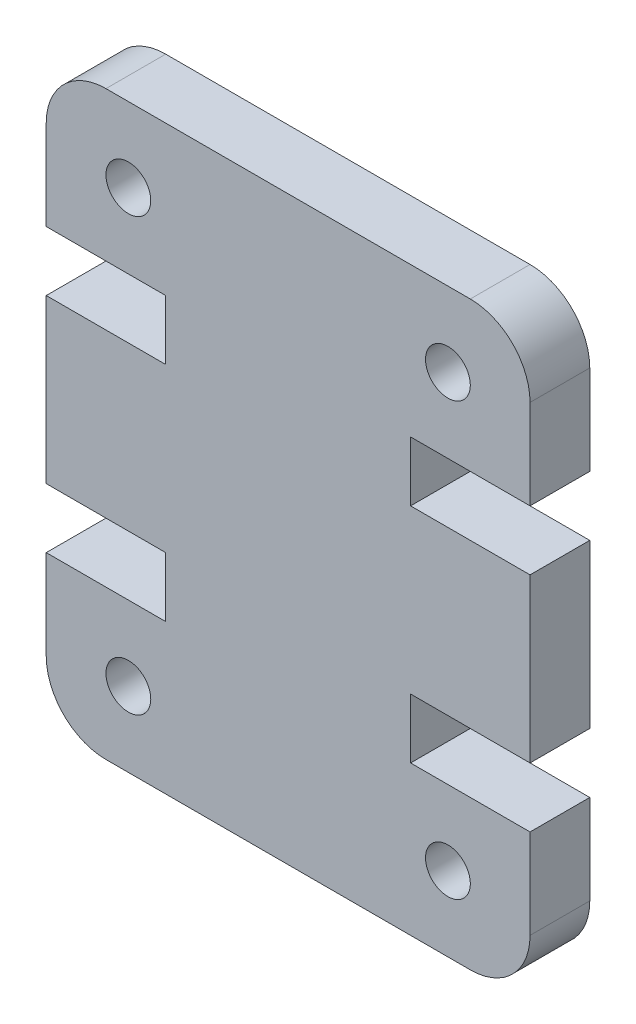
ISO-10303-21;
HEADER;
FILE_DESCRIPTION(('STEP AP214'),'2;1');
FILE_NAME('part.step','',(''),(''),'','','');
FILE_SCHEMA(('AUTOMOTIVE_DESIGN { 1 0 10303 214 1 1 1 1 }'));
ENDSEC;
DATA;
#1=APPLICATION_CONTEXT('core data for automotive mechanical design processes');
#2=APPLICATION_PROTOCOL_DEFINITION('international standard','automotive_design',2000,#1);
#3=PRODUCT_CONTEXT('',#1,'mechanical');
#4=PRODUCT('Part','Part','',(#3));
#5=PRODUCT_RELATED_PRODUCT_CATEGORY('part','',(#4));
#6=PRODUCT_DEFINITION_FORMATION('','',#4);
#7=PRODUCT_DEFINITION_CONTEXT('part definition',#1,'design');
#8=PRODUCT_DEFINITION('design','',#6,#7);
#9=PRODUCT_DEFINITION_SHAPE('','',#8);
#10=(LENGTH_UNIT() NAMED_UNIT(*) SI_UNIT(.MILLI.,.METRE.));
#11=(NAMED_UNIT(*) PLANE_ANGLE_UNIT() SI_UNIT($,.RADIAN.));
#12=(NAMED_UNIT(*) SI_UNIT($,.STERADIAN.) SOLID_ANGLE_UNIT());
#13=UNCERTAINTY_MEASURE_WITH_UNIT(LENGTH_MEASURE(1.E-05),#10,'distance_accuracy_value','');
#14=(GEOMETRIC_REPRESENTATION_CONTEXT(3) GLOBAL_UNCERTAINTY_ASSIGNED_CONTEXT((#13)) GLOBAL_UNIT_ASSIGNED_CONTEXT((#10,
#11,#12)) REPRESENTATION_CONTEXT('',''));
#15=CARTESIAN_POINT('',(0.,0.,0.));
#16=DIRECTION('',(0.,0.,1.));
#17=DIRECTION('',(1.,0.,0.));
#18=AXIS2_PLACEMENT_3D('',#15,#16,#17);
#19=CARTESIAN_POINT('',(14.1999999999999,2.00000000000013,2.));
#20=DIRECTION('',(0.,0.,-1.));
#21=DIRECTION('',(-1.,0.,0.));
#22=AXIS2_PLACEMENT_3D('',#19,#20,#21);
#23=PLANE('',#22);
#24=CARTESIAN_POINT('',(2.75000000000449,16.9549999999999,2.));
#25=DIRECTION('',(0.,0.,1.));
#26=DIRECTION('',(-1.,0.,0.));
#27=AXIS2_PLACEMENT_3D('',#24,#25,#26);
#28=CIRCLE('',#27,0.75);
#29=CARTESIAN_POINT('',(2.00000000000449,16.9549999999999,2.));
#30=VERTEX_POINT('',#29);
#31=EDGE_CURVE('E448',#30,#30,#28,.T.);
#32=ORIENTED_EDGE('',*,*,#31,.F.);
#33=EDGE_LOOP('',(#32));
#34=FACE_BOUND('',#33,.T.);
#35=CARTESIAN_POINT('',(13.4499999999955,2.50000000000005,2.));
#36=DIRECTION('',(0.,0.,1.));
#37=DIRECTION('',(-1.,0.,0.));
#38=AXIS2_PLACEMENT_3D('',#35,#36,#37);
#39=CIRCLE('',#38,0.750000000000006);
#40=CARTESIAN_POINT('',(12.6999999999955,2.50000000000005,2.));
#41=VERTEX_POINT('',#40);
#42=EDGE_CURVE('E230',#41,#41,#39,.T.);
#43=ORIENTED_EDGE('',*,*,#42,.F.);
#44=EDGE_LOOP('',(#43));
#45=FACE_BOUND('',#44,.T.);
#46=CARTESIAN_POINT('',(14.1999999999999,2.00000000000013,2.));
#47=DIRECTION('',(0.,0.,1.));
#48=DIRECTION('',(-1.,0.,0.));
#49=AXIS2_PLACEMENT_3D('',#46,#47,#48);
#50=CIRCLE('',#49,2.00000000000013);
#51=CARTESIAN_POINT('',(14.1999999999999,0.,2.));
#52=VERTEX_POINT('',#51);
#53=CARTESIAN_POINT('',(16.2,2.00000000000013,2.));
#54=VERTEX_POINT('',#53);
#55=EDGE_CURVE('E273',#52,#54,#50,.T.);
#56=ORIENTED_EDGE('',*,*,#55,.T.);
#57=DIRECTION('',(0.,1.,0.));
#58=VECTOR('',#57,1.);
#59=CARTESIAN_POINT('',(16.2,5.00000000000021,2.));
#60=LINE('',#59,#58);
#61=CARTESIAN_POINT('',(16.2,5.00000000000021,2.));
#62=VERTEX_POINT('',#61);
#63=EDGE_CURVE('E141',#54,#62,#60,.T.);
#64=ORIENTED_EDGE('',*,*,#63,.T.);
#65=DIRECTION('',(-1.,0.,0.));
#66=VECTOR('',#65,1.);
#67=CARTESIAN_POINT('',(12.1999999999997,5.00000000000021,2.));
#68=LINE('',#67,#66);
#69=CARTESIAN_POINT('',(12.1999999999997,5.00000000000021,2.));
#70=VERTEX_POINT('',#69);
#71=EDGE_CURVE('E336',#62,#70,#68,.T.);
#72=ORIENTED_EDGE('',*,*,#71,.T.);
#73=DIRECTION('',(0.,1.,0.));
#74=VECTOR('',#73,1.);
#75=CARTESIAN_POINT('',(12.1999999999997,7.00000000000034,2.));
#76=LINE('',#75,#74);
#77=CARTESIAN_POINT('',(12.1999999999997,7.00000000000034,2.));
#78=VERTEX_POINT('',#77);
#79=EDGE_CURVE('E355',#70,#78,#76,.T.);
#80=ORIENTED_EDGE('',*,*,#79,.T.);
#81=DIRECTION('',(1.,0.,0.));
#82=VECTOR('',#81,1.);
#83=CARTESIAN_POINT('',(16.2,7.00000000000034,2.));
#84=LINE('',#83,#82);
#85=CARTESIAN_POINT('',(16.2,7.00000000000034,2.));
#86=VERTEX_POINT('',#85);
#87=EDGE_CURVE('E352',#78,#86,#84,.T.);
#88=ORIENTED_EDGE('',*,*,#87,.T.);
#89=DIRECTION('',(0.,1.,0.));
#90=VECTOR('',#89,1.);
#91=CARTESIAN_POINT('',(16.2,7.00000000000034,2.));
#92=LINE('',#91,#90);
#93=CARTESIAN_POINT('',(16.2,12.4549999999997,2.));
#94=VERTEX_POINT('',#93);
#95=EDGE_CURVE('E354',#86,#94,#92,.T.);
#96=ORIENTED_EDGE('',*,*,#95,.T.);
#97=DIRECTION('',(-1.,0.,0.));
#98=VECTOR('',#97,1.);
#99=CARTESIAN_POINT('',(16.2,12.4549999999997,2.));
#100=LINE('',#99,#98);
#101=CARTESIAN_POINT('',(12.1999999999997,12.4549999999997,2.));
#102=VERTEX_POINT('',#101);
#103=EDGE_CURVE('E357',#94,#102,#100,.T.);
#104=ORIENTED_EDGE('',*,*,#103,.T.);
#105=DIRECTION('',(0.,1.,0.));
#106=VECTOR('',#105,1.);
#107=CARTESIAN_POINT('',(12.1999999999997,12.4549999999997,2.));
#108=LINE('',#107,#106);
#109=CARTESIAN_POINT('',(12.1999999999997,14.4549999999998,2.));
#110=VERTEX_POINT('',#109);
#111=EDGE_CURVE('E363',#102,#110,#108,.T.);
#112=ORIENTED_EDGE('',*,*,#111,.T.);
#113=DIRECTION('',(1.,0.,0.));
#114=VECTOR('',#113,1.);
#115=CARTESIAN_POINT('',(12.1999999999997,14.4549999999998,2.));
#116=LINE('',#115,#114);
#117=CARTESIAN_POINT('',(16.2,14.4549999999998,2.));
#118=VERTEX_POINT('',#117);
#119=EDGE_CURVE('E365',#110,#118,#116,.T.);
#120=ORIENTED_EDGE('',*,*,#119,.T.);
#121=DIRECTION('',(0.,1.,0.));
#122=VECTOR('',#121,1.);
#123=CARTESIAN_POINT('',(16.2,14.4549999999998,2.));
#124=LINE('',#123,#122);
#125=CARTESIAN_POINT('',(16.2,17.4549999999999,2.));
#126=VERTEX_POINT('',#125);
#127=EDGE_CURVE('E367',#118,#126,#124,.T.);
#128=ORIENTED_EDGE('',*,*,#127,.T.);
#129=CARTESIAN_POINT('',(14.1999999999999,17.4549999999999,2.));
#130=DIRECTION('',(0.,0.,1.));
#131=DIRECTION('',(1.,0.,0.));
#132=AXIS2_PLACEMENT_3D('',#129,#130,#131);
#133=CIRCLE('',#132,2.00000000000013);
#134=CARTESIAN_POINT('',(14.1999999999999,19.455,2.));
#135=VERTEX_POINT('',#134);
#136=EDGE_CURVE('E369',#126,#135,#133,.T.);
#137=ORIENTED_EDGE('',*,*,#136,.T.);
#138=DIRECTION('',(-1.,0.,0.));
#139=VECTOR('',#138,1.);
#140=CARTESIAN_POINT('',(2.00000000000012,19.455,2.));
#141=LINE('',#140,#139);
#142=CARTESIAN_POINT('',(2.00000000000012,19.455,2.));
#143=VERTEX_POINT('',#142);
#144=EDGE_CURVE('E371',#135,#143,#141,.T.);
#145=ORIENTED_EDGE('',*,*,#144,.T.);
#146=CARTESIAN_POINT('',(2.00000000000012,17.4549999999999,2.));
#147=DIRECTION('',(0.,0.,1.));
#148=DIRECTION('',(-1.,0.,0.));
#149=AXIS2_PLACEMENT_3D('',#146,#147,#148);
#150=CIRCLE('',#149,2.00000000000013);
#151=CARTESIAN_POINT('',(0.,17.4549999999999,2.));
#152=VERTEX_POINT('',#151);
#153=EDGE_CURVE('E373',#143,#152,#150,.T.);
#154=ORIENTED_EDGE('',*,*,#153,.T.);
#155=DIRECTION('',(0.,-1.,0.));
#156=VECTOR('',#155,1.);
#157=CARTESIAN_POINT('',(0.,14.4549999999998,2.));
#158=LINE('',#157,#156);
#159=CARTESIAN_POINT('',(0.,14.4549999999998,2.));
#160=VERTEX_POINT('',#159);
#161=EDGE_CURVE('E375',#152,#160,#158,.T.);
#162=ORIENTED_EDGE('',*,*,#161,.T.);
#163=DIRECTION('',(1.,0.,0.));
#164=VECTOR('',#163,1.);
#165=CARTESIAN_POINT('',(4.00000000000025,14.4549999999998,2.));
#166=LINE('',#165,#164);
#167=CARTESIAN_POINT('',(4.00000000000025,14.4549999999998,2.));
#168=VERTEX_POINT('',#167);
#169=EDGE_CURVE('E377',#160,#168,#166,.T.);
#170=ORIENTED_EDGE('',*,*,#169,.T.);
#171=DIRECTION('',(0.,-1.,0.));
#172=VECTOR('',#171,1.);
#173=CARTESIAN_POINT('',(4.00000000000025,12.4549999999997,2.));
#174=LINE('',#173,#172);
#175=CARTESIAN_POINT('',(4.00000000000025,12.4549999999997,2.));
#176=VERTEX_POINT('',#175);
#177=EDGE_CURVE('E379',#168,#176,#174,.T.);
#178=ORIENTED_EDGE('',*,*,#177,.T.);
#179=DIRECTION('',(-1.,0.,0.));
#180=VECTOR('',#179,1.);
#181=CARTESIAN_POINT('',(0.,12.4549999999997,2.));
#182=LINE('',#181,#180);
#183=CARTESIAN_POINT('',(0.,12.4549999999997,2.));
#184=VERTEX_POINT('',#183);
#185=EDGE_CURVE('E381',#176,#184,#182,.T.);
#186=ORIENTED_EDGE('',*,*,#185,.T.);
#187=DIRECTION('',(0.,-1.,0.));
#188=VECTOR('',#187,1.);
#189=CARTESIAN_POINT('',(0.,7.00000000000034,2.));
#190=LINE('',#189,#188);
#191=CARTESIAN_POINT('',(0.,7.00000000000034,2.));
#192=VERTEX_POINT('',#191);
#193=EDGE_CURVE('E383',#184,#192,#190,.T.);
#194=ORIENTED_EDGE('',*,*,#193,.T.);
#195=DIRECTION('',(1.,0.,0.));
#196=VECTOR('',#195,1.);
#197=CARTESIAN_POINT('',(0.,7.00000000000034,2.));
#198=LINE('',#197,#196);
#199=CARTESIAN_POINT('',(4.00000000000016,7.00000000000031,2.));
#200=VERTEX_POINT('',#199);
#201=EDGE_CURVE('E385',#192,#200,#198,.T.);
#202=ORIENTED_EDGE('',*,*,#201,.T.);
#203=DIRECTION('',(0.,-1.,0.));
#204=VECTOR('',#203,1.);
#205=CARTESIAN_POINT('',(4.00000000000016,7.00000000000031,2.));
#206=LINE('',#205,#204);
#207=CARTESIAN_POINT('',(4.00000000000016,5.00000000000021,2.));
#208=VERTEX_POINT('',#207);
#209=EDGE_CURVE('E387',#200,#208,#206,.T.);
#210=ORIENTED_EDGE('',*,*,#209,.T.);
#211=DIRECTION('',(-1.,0.,0.));
#212=VECTOR('',#211,1.);
#213=CARTESIAN_POINT('',(4.00000000000016,5.00000000000021,2.));
#214=LINE('',#213,#212);
#215=CARTESIAN_POINT('',(0.,5.00000000000021,2.));
#216=VERTEX_POINT('',#215);
#217=EDGE_CURVE('E208',#208,#216,#214,.T.);
#218=ORIENTED_EDGE('',*,*,#217,.T.);
#219=DIRECTION('',(0.,-1.,0.));
#220=VECTOR('',#219,1.);
#221=CARTESIAN_POINT('',(0.,5.00000000000021,2.));
#222=LINE('',#221,#220);
#223=CARTESIAN_POINT('',(0.,2.0000000000001,2.));
#224=VERTEX_POINT('',#223);
#225=EDGE_CURVE('E202',#216,#224,#222,.T.);
#226=ORIENTED_EDGE('',*,*,#225,.T.);
#227=CARTESIAN_POINT('',(2.00000000000007,2.00000000000013,2.));
#228=DIRECTION('',(0.,0.,1.));
#229=DIRECTION('',(1.,0.,0.));
#230=AXIS2_PLACEMENT_3D('',#227,#228,#229);
#231=CIRCLE('',#230,2.0000000000001);
#232=CARTESIAN_POINT('',(2.00000000000008,0.,2.));
#233=VERTEX_POINT('',#232);
#234=EDGE_CURVE('E206',#224,#233,#231,.T.);
#235=ORIENTED_EDGE('',*,*,#234,.T.);
#236=DIRECTION('',(1.,0.,0.));
#237=VECTOR('',#236,1.);
#238=CARTESIAN_POINT('',(2.00000000000008,0.,2.));
#239=LINE('',#238,#237);
#240=EDGE_CURVE('E50',#233,#52,#239,.T.);
#241=ORIENTED_EDGE('',*,*,#240,.T.);
#242=EDGE_LOOP('',(#56,#64,#72,#80,#88,#96,#104,#112,#120,#128,#137,#145,#154,#162,#170,#178,
#186,#194,#202,#210,#218,#226,#235,#241));
#243=FACE_BOUND('',#242,.T.);
#244=CARTESIAN_POINT('',(2.7500000000045,2.50000000000004,2.));
#245=DIRECTION('',(0.,0.,1.));
#246=DIRECTION('',(1.,0.,0.));
#247=AXIS2_PLACEMENT_3D('',#244,#245,#246);
#248=CIRCLE('',#247,0.75);
#249=CARTESIAN_POINT('',(3.5000000000045,2.50000000000004,2.));
#250=VERTEX_POINT('',#249);
#251=EDGE_CURVE('E454',#250,#250,#248,.T.);
#252=ORIENTED_EDGE('',*,*,#251,.F.);
#253=EDGE_LOOP('',(#252));
#254=FACE_BOUND('',#253,.T.);
#255=CARTESIAN_POINT('',(13.4499999999955,16.9549999999999,2.));
#256=DIRECTION('',(0.,0.,1.));
#257=DIRECTION('',(1.,0.,0.));
#258=AXIS2_PLACEMENT_3D('',#255,#256,#257);
#259=CIRCLE('',#258,0.750000000000005);
#260=CARTESIAN_POINT('',(14.1999999999955,16.9549999999999,2.));
#261=VERTEX_POINT('',#260);
#262=EDGE_CURVE('E439',#261,#261,#259,.T.);
#263=ORIENTED_EDGE('',*,*,#262,.F.);
#264=EDGE_LOOP('',(#263));
#265=FACE_BOUND('',#264,.T.);
#266=ADVANCED_FACE('F33',(#34,#45,#243,#254,#265),#23,.F.);
#267=CARTESIAN_POINT('',(14.1999999999999,2.00000000000013,0.));
#268=DIRECTION('',(0.,0.,-1.));
#269=DIRECTION('',(-1.,0.,0.));
#270=AXIS2_PLACEMENT_3D('',#267,#268,#269);
#271=PLANE('',#270);
#272=CARTESIAN_POINT('',(2.75000000000449,16.9549999999999,0.));
#273=DIRECTION('',(0.,0.,1.));
#274=DIRECTION('',(-1.,0.,0.));
#275=AXIS2_PLACEMENT_3D('',#272,#273,#274);
#276=CIRCLE('',#275,0.75);
#277=CARTESIAN_POINT('',(2.00000000000449,16.9549999999999,0.));
#278=VERTEX_POINT('',#277);
#279=EDGE_CURVE('E445',#278,#278,#276,.T.);
#280=ORIENTED_EDGE('',*,*,#279,.T.);
#281=EDGE_LOOP('',(#280));
#282=FACE_BOUND('',#281,.T.);
#283=CARTESIAN_POINT('',(13.4499999999955,2.50000000000005,0.));
#284=DIRECTION('',(0.,0.,1.));
#285=DIRECTION('',(-1.,0.,0.));
#286=AXIS2_PLACEMENT_3D('',#283,#284,#285);
#287=CIRCLE('',#286,0.750000000000006);
#288=CARTESIAN_POINT('',(12.6999999999955,2.50000000000005,0.));
#289=VERTEX_POINT('',#288);
#290=EDGE_CURVE('E457',#289,#289,#287,.T.);
#291=ORIENTED_EDGE('',*,*,#290,.T.);
#292=EDGE_LOOP('',(#291));
#293=FACE_BOUND('',#292,.T.);
#294=CARTESIAN_POINT('',(14.1999999999999,2.00000000000013,0.));
#295=DIRECTION('',(0.,0.,1.));
#296=DIRECTION('',(-1.,0.,0.));
#297=AXIS2_PLACEMENT_3D('',#294,#295,#296);
#298=CIRCLE('',#297,2.00000000000013);
#299=CARTESIAN_POINT('',(14.1999999999999,0.,0.));
#300=VERTEX_POINT('',#299);
#301=CARTESIAN_POINT('',(16.2,2.00000000000013,0.));
#302=VERTEX_POINT('',#301);
#303=EDGE_CURVE('E226',#300,#302,#298,.T.);
#304=ORIENTED_EDGE('',*,*,#303,.F.);
#305=DIRECTION('',(1.,0.,0.));
#306=VECTOR('',#305,1.);
#307=CARTESIAN_POINT('',(2.00000000000008,0.,0.));
#308=LINE('',#307,#306);
#309=CARTESIAN_POINT('',(2.00000000000008,0.,0.));
#310=VERTEX_POINT('',#309);
#311=EDGE_CURVE('E133',#310,#300,#308,.T.);
#312=ORIENTED_EDGE('',*,*,#311,.F.);
#313=CARTESIAN_POINT('',(2.00000000000007,2.00000000000013,0.));
#314=DIRECTION('',(0.,0.,1.));
#315=DIRECTION('',(1.,0.,0.));
#316=AXIS2_PLACEMENT_3D('',#313,#314,#315);
#317=CIRCLE('',#316,2.0000000000001);
#318=CARTESIAN_POINT('',(0.,2.0000000000001,0.));
#319=VERTEX_POINT('',#318);
#320=EDGE_CURVE('E127',#319,#310,#317,.T.);
#321=ORIENTED_EDGE('',*,*,#320,.F.);
#322=DIRECTION('',(0.,-1.,0.));
#323=VECTOR('',#322,1.);
#324=CARTESIAN_POINT('',(0.,5.00000000000021,0.));
#325=LINE('',#324,#323);
#326=CARTESIAN_POINT('',(0.,5.00000000000021,0.));
#327=VERTEX_POINT('',#326);
#328=EDGE_CURVE('E216',#327,#319,#325,.T.);
#329=ORIENTED_EDGE('',*,*,#328,.F.);
#330=DIRECTION('',(-1.,0.,0.));
#331=VECTOR('',#330,1.);
#332=CARTESIAN_POINT('',(4.00000000000016,5.00000000000021,0.));
#333=LINE('',#332,#331);
#334=CARTESIAN_POINT('',(4.00000000000016,5.00000000000021,0.));
#335=VERTEX_POINT('',#334);
#336=EDGE_CURVE('E268',#335,#327,#333,.T.);
#337=ORIENTED_EDGE('',*,*,#336,.F.);
#338=DIRECTION('',(0.,-1.,0.));
#339=VECTOR('',#338,1.);
#340=CARTESIAN_POINT('',(4.00000000000016,7.00000000000031,0.));
#341=LINE('',#340,#339);
#342=CARTESIAN_POINT('',(4.00000000000016,7.00000000000031,0.));
#343=VERTEX_POINT('',#342);
#344=EDGE_CURVE('E266',#343,#335,#341,.T.);
#345=ORIENTED_EDGE('',*,*,#344,.F.);
#346=DIRECTION('',(1.,0.,0.));
#347=VECTOR('',#346,1.);
#348=CARTESIAN_POINT('',(0.,7.00000000000034,0.));
#349=LINE('',#348,#347);
#350=CARTESIAN_POINT('',(0.,7.00000000000034,0.));
#351=VERTEX_POINT('',#350);
#352=EDGE_CURVE('E264',#351,#343,#349,.T.);
#353=ORIENTED_EDGE('',*,*,#352,.F.);
#354=DIRECTION('',(0.,-1.,0.));
#355=VECTOR('',#354,1.);
#356=CARTESIAN_POINT('',(0.,7.00000000000034,0.));
#357=LINE('',#356,#355);
#358=CARTESIAN_POINT('',(0.,12.4549999999997,0.));
#359=VERTEX_POINT('',#358);
#360=EDGE_CURVE('E262',#359,#351,#357,.T.);
#361=ORIENTED_EDGE('',*,*,#360,.F.);
#362=DIRECTION('',(-1.,0.,0.));
#363=VECTOR('',#362,1.);
#364=CARTESIAN_POINT('',(0.,12.4549999999997,0.));
#365=LINE('',#364,#363);
#366=CARTESIAN_POINT('',(4.00000000000025,12.4549999999997,0.));
#367=VERTEX_POINT('',#366);
#368=EDGE_CURVE('E260',#367,#359,#365,.T.);
#369=ORIENTED_EDGE('',*,*,#368,.F.);
#370=DIRECTION('',(0.,-1.,0.));
#371=VECTOR('',#370,1.);
#372=CARTESIAN_POINT('',(4.00000000000025,12.4549999999997,0.));
#373=LINE('',#372,#371);
#374=CARTESIAN_POINT('',(4.00000000000025,14.4549999999998,0.));
#375=VERTEX_POINT('',#374);
#376=EDGE_CURVE('E258',#375,#367,#373,.T.);
#377=ORIENTED_EDGE('',*,*,#376,.F.);
#378=DIRECTION('',(1.,0.,0.));
#379=VECTOR('',#378,1.);
#380=CARTESIAN_POINT('',(4.00000000000025,14.4549999999998,0.));
#381=LINE('',#380,#379);
#382=CARTESIAN_POINT('',(0.,14.4549999999998,0.));
#383=VERTEX_POINT('',#382);
#384=EDGE_CURVE('E256',#383,#375,#381,.T.);
#385=ORIENTED_EDGE('',*,*,#384,.F.);
#386=DIRECTION('',(0.,-1.,0.));
#387=VECTOR('',#386,1.);
#388=CARTESIAN_POINT('',(0.,14.4549999999998,0.));
#389=LINE('',#388,#387);
#390=CARTESIAN_POINT('',(0.,17.4549999999999,0.));
#391=VERTEX_POINT('',#390);
#392=EDGE_CURVE('E254',#391,#383,#389,.T.);
#393=ORIENTED_EDGE('',*,*,#392,.F.);
#394=CARTESIAN_POINT('',(2.00000000000012,17.4549999999999,0.));
#395=DIRECTION('',(0.,0.,1.));
#396=DIRECTION('',(-1.,0.,0.));
#397=AXIS2_PLACEMENT_3D('',#394,#395,#396);
#398=CIRCLE('',#397,2.00000000000013);
#399=CARTESIAN_POINT('',(2.00000000000012,19.455,0.));
#400=VERTEX_POINT('',#399);
#401=EDGE_CURVE('E252',#400,#391,#398,.T.);
#402=ORIENTED_EDGE('',*,*,#401,.F.);
#403=DIRECTION('',(-1.,0.,0.));
#404=VECTOR('',#403,1.);
#405=CARTESIAN_POINT('',(2.00000000000012,19.455,0.));
#406=LINE('',#405,#404);
#407=CARTESIAN_POINT('',(14.1999999999999,19.455,0.));
#408=VERTEX_POINT('',#407);
#409=EDGE_CURVE('E250',#408,#400,#406,.T.);
#410=ORIENTED_EDGE('',*,*,#409,.F.);
#411=CARTESIAN_POINT('',(14.1999999999999,17.4549999999999,0.));
#412=DIRECTION('',(0.,0.,1.));
#413=DIRECTION('',(1.,0.,0.));
#414=AXIS2_PLACEMENT_3D('',#411,#412,#413);
#415=CIRCLE('',#414,2.00000000000013);
#416=CARTESIAN_POINT('',(16.2,17.4549999999999,0.));
#417=VERTEX_POINT('',#416);
#418=EDGE_CURVE('E248',#417,#408,#415,.T.);
#419=ORIENTED_EDGE('',*,*,#418,.F.);
#420=DIRECTION('',(0.,1.,0.));
#421=VECTOR('',#420,1.);
#422=CARTESIAN_POINT('',(16.2,14.4549999999998,0.));
#423=LINE('',#422,#421);
#424=CARTESIAN_POINT('',(16.2,14.4549999999998,0.));
#425=VERTEX_POINT('',#424);
#426=EDGE_CURVE('E246',#425,#417,#423,.T.);
#427=ORIENTED_EDGE('',*,*,#426,.F.);
#428=DIRECTION('',(1.,0.,0.));
#429=VECTOR('',#428,1.);
#430=CARTESIAN_POINT('',(12.1999999999997,14.4549999999998,0.));
#431=LINE('',#430,#429);
#432=CARTESIAN_POINT('',(12.1999999999997,14.4549999999998,0.));
#433=VERTEX_POINT('',#432);
#434=EDGE_CURVE('E244',#433,#425,#431,.T.);
#435=ORIENTED_EDGE('',*,*,#434,.F.);
#436=DIRECTION('',(0.,1.,0.));
#437=VECTOR('',#436,1.);
#438=CARTESIAN_POINT('',(12.1999999999997,12.4549999999997,0.));
#439=LINE('',#438,#437);
#440=CARTESIAN_POINT('',(12.1999999999997,12.4549999999997,0.));
#441=VERTEX_POINT('',#440);
#442=EDGE_CURVE('E242',#441,#433,#439,.T.);
#443=ORIENTED_EDGE('',*,*,#442,.F.);
#444=DIRECTION('',(-1.,0.,0.));
#445=VECTOR('',#444,1.);
#446=CARTESIAN_POINT('',(16.2,12.4549999999997,0.));
#447=LINE('',#446,#445);
#448=CARTESIAN_POINT('',(16.2,12.4549999999997,0.));
#449=VERTEX_POINT('',#448);
#450=EDGE_CURVE('E240',#449,#441,#447,.T.);
#451=ORIENTED_EDGE('',*,*,#450,.F.);
#452=DIRECTION('',(0.,1.,0.));
#453=VECTOR('',#452,1.);
#454=CARTESIAN_POINT('',(16.2,7.00000000000034,0.));
#455=LINE('',#454,#453);
#456=CARTESIAN_POINT('',(16.2,7.00000000000034,0.));
#457=VERTEX_POINT('',#456);
#458=EDGE_CURVE('E238',#457,#449,#455,.T.);
#459=ORIENTED_EDGE('',*,*,#458,.F.);
#460=DIRECTION('',(1.,0.,0.));
#461=VECTOR('',#460,1.);
#462=CARTESIAN_POINT('',(16.2,7.00000000000034,0.));
#463=LINE('',#462,#461);
#464=CARTESIAN_POINT('',(12.1999999999997,7.00000000000034,0.));
#465=VERTEX_POINT('',#464);
#466=EDGE_CURVE('E236',#465,#457,#463,.T.);
#467=ORIENTED_EDGE('',*,*,#466,.F.);
#468=DIRECTION('',(0.,1.,0.));
#469=VECTOR('',#468,1.);
#470=CARTESIAN_POINT('',(12.1999999999997,7.00000000000034,0.));
#471=LINE('',#470,#469);
#472=CARTESIAN_POINT('',(12.1999999999997,5.00000000000021,0.));
#473=VERTEX_POINT('',#472);
#474=EDGE_CURVE('E234',#473,#465,#471,.T.);
#475=ORIENTED_EDGE('',*,*,#474,.F.);
#476=DIRECTION('',(-1.,0.,0.));
#477=VECTOR('',#476,1.);
#478=CARTESIAN_POINT('',(12.1999999999997,5.00000000000021,0.));
#479=LINE('',#478,#477);
#480=CARTESIAN_POINT('',(16.2,5.00000000000021,0.));
#481=VERTEX_POINT('',#480);
#482=EDGE_CURVE('E232',#481,#473,#479,.T.);
#483=ORIENTED_EDGE('',*,*,#482,.F.);
#484=DIRECTION('',(0.,1.,0.));
#485=VECTOR('',#484,1.);
#486=CARTESIAN_POINT('',(16.2,5.00000000000021,0.));
#487=LINE('',#486,#485);
#488=EDGE_CURVE('E229',#302,#481,#487,.T.);
#489=ORIENTED_EDGE('',*,*,#488,.F.);
#490=EDGE_LOOP('',(#304,#312,#321,#329,#337,#345,#353,#361,#369,#377,#385,#393,#402,#410,#419,
#427,#435,#443,#451,#459,#467,#475,#483,#489));
#491=FACE_BOUND('',#490,.T.);
#492=CARTESIAN_POINT('',(2.7500000000045,2.50000000000004,0.));
#493=DIRECTION('',(0.,0.,1.));
#494=DIRECTION('',(1.,0.,0.));
#495=AXIS2_PLACEMENT_3D('',#492,#493,#494);
#496=CIRCLE('',#495,0.75);
#497=CARTESIAN_POINT('',(3.5000000000045,2.50000000000004,0.));
#498=VERTEX_POINT('',#497);
#499=EDGE_CURVE('E451',#498,#498,#496,.T.);
#500=ORIENTED_EDGE('',*,*,#499,.T.);
#501=EDGE_LOOP('',(#500));
#502=FACE_BOUND('',#501,.T.);
#503=CARTESIAN_POINT('',(13.4499999999955,16.9549999999999,0.));
#504=DIRECTION('',(0.,0.,1.));
#505=DIRECTION('',(1.,0.,0.));
#506=AXIS2_PLACEMENT_3D('',#503,#504,#505);
#507=CIRCLE('',#506,0.750000000000005);
#508=CARTESIAN_POINT('',(14.1999999999955,16.9549999999999,0.));
#509=VERTEX_POINT('',#508);
#510=EDGE_CURVE('E442',#509,#509,#507,.T.);
#511=ORIENTED_EDGE('',*,*,#510,.T.);
#512=EDGE_LOOP('',(#511));
#513=FACE_BOUND('',#512,.T.);
#514=ADVANCED_FACE('F340',(#282,#293,#491,#502,#513),#271,.T.);
#515=CARTESIAN_POINT('',(14.1999999999999,2.00000000000013,2.));
#516=DIRECTION('',(0.,0.,-1.));
#517=DIRECTION('',(-1.,0.,0.));
#518=AXIS2_PLACEMENT_3D('',#515,#516,#517);
#519=CYLINDRICAL_SURFACE('',#518,2.00000000000013);
#520=ORIENTED_EDGE('',*,*,#303,.T.);
#521=DIRECTION('',(0.,0.,-1.));
#522=VECTOR('',#521,1.);
#523=CARTESIAN_POINT('',(16.2,2.00000000000013,2.));
#524=LINE('',#523,#522);
#525=EDGE_CURVE('E11',#54,#302,#524,.T.);
#526=ORIENTED_EDGE('',*,*,#525,.F.);
#527=ORIENTED_EDGE('',*,*,#55,.F.);
#528=DIRECTION('',(0.,0.,-1.));
#529=VECTOR('',#528,1.);
#530=CARTESIAN_POINT('',(14.1999999999999,0.,2.));
#531=LINE('',#530,#529);
#532=EDGE_CURVE('E222',#52,#300,#531,.T.);
#533=ORIENTED_EDGE('',*,*,#532,.T.);
#534=EDGE_LOOP('',(#520,#526,#527,#533));
#535=FACE_BOUND('',#534,.T.);
#536=ADVANCED_FACE('F35',(#535),#519,.T.);
#537=CARTESIAN_POINT('',(16.2,5.00000000000021,2.));
#538=DIRECTION('',(-1.,0.,0.));
#539=DIRECTION('',(0.,0.,1.));
#540=AXIS2_PLACEMENT_3D('',#537,#538,#539);
#541=PLANE('',#540);
#542=ORIENTED_EDGE('',*,*,#488,.T.);
#543=DIRECTION('',(0.,0.,-1.));
#544=VECTOR('',#543,1.);
#545=CARTESIAN_POINT('',(16.2,5.00000000000021,2.));
#546=LINE('',#545,#544);
#547=EDGE_CURVE('E42',#62,#481,#546,.T.);
#548=ORIENTED_EDGE('',*,*,#547,.F.);
#549=ORIENTED_EDGE('',*,*,#63,.F.);
#550=ORIENTED_EDGE('',*,*,#525,.T.);
#551=EDGE_LOOP('',(#542,#548,#549,#550));
#552=FACE_BOUND('',#551,.T.);
#553=ADVANCED_FACE('F686',(#552),#541,.F.);
#554=CARTESIAN_POINT('',(12.1999999999997,5.00000000000021,2.));
#555=DIRECTION('',(0.,-1.,0.));
#556=DIRECTION('',(0.,0.,-1.));
#557=AXIS2_PLACEMENT_3D('',#554,#555,#556);
#558=PLANE('',#557);
#559=ORIENTED_EDGE('',*,*,#482,.T.);
#560=DIRECTION('',(0.,0.,-1.));
#561=VECTOR('',#560,1.);
#562=CARTESIAN_POINT('',(12.1999999999997,5.00000000000021,2.));
#563=LINE('',#562,#561);
#564=EDGE_CURVE('E328',#70,#473,#563,.T.);
#565=ORIENTED_EDGE('',*,*,#564,.F.);
#566=ORIENTED_EDGE('',*,*,#71,.F.);
#567=ORIENTED_EDGE('',*,*,#547,.T.);
#568=EDGE_LOOP('',(#559,#565,#566,#567));
#569=FACE_BOUND('',#568,.T.);
#570=ADVANCED_FACE('F334',(#569),#558,.F.);
#571=CARTESIAN_POINT('',(12.1999999999997,7.00000000000034,2.));
#572=DIRECTION('',(-1.,0.,0.));
#573=DIRECTION('',(0.,0.,1.));
#574=AXIS2_PLACEMENT_3D('',#571,#572,#573);
#575=PLANE('',#574);
#576=ORIENTED_EDGE('',*,*,#474,.T.);
#577=DIRECTION('',(0.,0.,-1.));
#578=VECTOR('',#577,1.);
#579=CARTESIAN_POINT('',(12.1999999999997,7.00000000000034,2.));
#580=LINE('',#579,#578);
#581=EDGE_CURVE('E325',#78,#465,#580,.T.);
#582=ORIENTED_EDGE('',*,*,#581,.F.);
#583=ORIENTED_EDGE('',*,*,#79,.F.);
#584=ORIENTED_EDGE('',*,*,#564,.T.);
#585=EDGE_LOOP('',(#576,#582,#583,#584));
#586=FACE_BOUND('',#585,.T.);
#587=ADVANCED_FACE('F346',(#586),#575,.F.);
#588=CARTESIAN_POINT('',(16.2,7.00000000000034,2.));
#589=DIRECTION('',(0.,1.,0.));
#590=DIRECTION('',(-1.,0.,0.));
#591=AXIS2_PLACEMENT_3D('',#588,#589,#590);
#592=PLANE('',#591);
#593=ORIENTED_EDGE('',*,*,#466,.T.);
#594=DIRECTION('',(0.,0.,-1.));
#595=VECTOR('',#594,1.);
#596=CARTESIAN_POINT('',(16.2,7.00000000000034,2.));
#597=LINE('',#596,#595);
#598=EDGE_CURVE('E322',#86,#457,#597,.T.);
#599=ORIENTED_EDGE('',*,*,#598,.F.);
#600=ORIENTED_EDGE('',*,*,#87,.F.);
#601=ORIENTED_EDGE('',*,*,#581,.T.);
#602=EDGE_LOOP('',(#593,#599,#600,#601));
#603=FACE_BOUND('',#602,.T.);
#604=ADVANCED_FACE('F350',(#603),#592,.F.);
#605=CARTESIAN_POINT('',(16.2,7.00000000000034,2.));
#606=DIRECTION('',(-1.,0.,0.));
#607=DIRECTION('',(0.,0.,1.));
#608=AXIS2_PLACEMENT_3D('',#605,#606,#607);
#609=PLANE('',#608);
#610=ORIENTED_EDGE('',*,*,#458,.T.);
#611=DIRECTION('',(0.,0.,-1.));
#612=VECTOR('',#611,1.);
#613=CARTESIAN_POINT('',(16.2,12.4549999999997,2.));
#614=LINE('',#613,#612);
#615=EDGE_CURVE('E319',#94,#449,#614,.T.);
#616=ORIENTED_EDGE('',*,*,#615,.F.);
#617=ORIENTED_EDGE('',*,*,#95,.F.);
#618=ORIENTED_EDGE('',*,*,#598,.T.);
#619=EDGE_LOOP('',(#610,#616,#617,#618));
#620=FACE_BOUND('',#619,.T.);
#621=ADVANCED_FACE('F651',(#620),#609,.F.);
#622=CARTESIAN_POINT('',(16.2,12.4549999999997,2.));
#623=DIRECTION('',(0.,-1.,0.));
#624=DIRECTION('',(1.,0.,0.));
#625=AXIS2_PLACEMENT_3D('',#622,#623,#624);
#626=PLANE('',#625);
#627=ORIENTED_EDGE('',*,*,#450,.T.);
#628=DIRECTION('',(0.,0.,-1.));
#629=VECTOR('',#628,1.);
#630=CARTESIAN_POINT('',(12.1999999999997,12.4549999999997,2.));
#631=LINE('',#630,#629);
#632=EDGE_CURVE('E316',#102,#441,#631,.T.);
#633=ORIENTED_EDGE('',*,*,#632,.F.);
#634=ORIENTED_EDGE('',*,*,#103,.F.);
#635=ORIENTED_EDGE('',*,*,#615,.T.);
#636=EDGE_LOOP('',(#627,#633,#634,#635));
#637=FACE_BOUND('',#636,.T.);
#638=ADVANCED_FACE('F641',(#637),#626,.F.);
#639=CARTESIAN_POINT('',(12.1999999999997,12.4549999999997,2.));
#640=DIRECTION('',(-1.,0.,0.));
#641=DIRECTION('',(0.,0.,1.));
#642=AXIS2_PLACEMENT_3D('',#639,#640,#641);
#643=PLANE('',#642);
#644=ORIENTED_EDGE('',*,*,#442,.T.);
#645=DIRECTION('',(0.,0.,-1.));
#646=VECTOR('',#645,1.);
#647=CARTESIAN_POINT('',(12.1999999999997,14.4549999999998,2.));
#648=LINE('',#647,#646);
#649=EDGE_CURVE('E313',#110,#433,#648,.T.);
#650=ORIENTED_EDGE('',*,*,#649,.F.);
#651=ORIENTED_EDGE('',*,*,#111,.F.);
#652=ORIENTED_EDGE('',*,*,#632,.T.);
#653=EDGE_LOOP('',(#644,#650,#651,#652));
#654=FACE_BOUND('',#653,.T.);
#655=ADVANCED_FACE('F631',(#654),#643,.F.);
#656=CARTESIAN_POINT('',(12.1999999999997,14.4549999999998,2.));
#657=DIRECTION('',(0.,1.,0.));
#658=DIRECTION('',(0.,0.,1.));
#659=AXIS2_PLACEMENT_3D('',#656,#657,#658);
#660=PLANE('',#659);
#661=ORIENTED_EDGE('',*,*,#434,.T.);
#662=DIRECTION('',(0.,0.,-1.));
#663=VECTOR('',#662,1.);
#664=CARTESIAN_POINT('',(16.2,14.4549999999998,2.));
#665=LINE('',#664,#663);
#666=EDGE_CURVE('E310',#118,#425,#665,.T.);
#667=ORIENTED_EDGE('',*,*,#666,.F.);
#668=ORIENTED_EDGE('',*,*,#119,.F.);
#669=ORIENTED_EDGE('',*,*,#649,.T.);
#670=EDGE_LOOP('',(#661,#667,#668,#669));
#671=FACE_BOUND('',#670,.T.);
#672=ADVANCED_FACE('F621',(#671),#660,.F.);
#673=CARTESIAN_POINT('',(16.2,14.4549999999998,2.));
#674=DIRECTION('',(-1.,0.,0.));
#675=DIRECTION('',(0.,0.,1.));
#676=AXIS2_PLACEMENT_3D('',#673,#674,#675);
#677=PLANE('',#676);
#678=ORIENTED_EDGE('',*,*,#426,.T.);
#679=DIRECTION('',(0.,0.,-1.));
#680=VECTOR('',#679,1.);
#681=CARTESIAN_POINT('',(16.2,17.4549999999999,2.));
#682=LINE('',#681,#680);
#683=EDGE_CURVE('E307',#126,#417,#682,.T.);
#684=ORIENTED_EDGE('',*,*,#683,.F.);
#685=ORIENTED_EDGE('',*,*,#127,.F.);
#686=ORIENTED_EDGE('',*,*,#666,.T.);
#687=EDGE_LOOP('',(#678,#684,#685,#686));
#688=FACE_BOUND('',#687,.T.);
#689=ADVANCED_FACE('F611',(#688),#677,.F.);
#690=CARTESIAN_POINT('',(14.1999999999999,17.4549999999999,2.));
#691=DIRECTION('',(0.,0.,-1.));
#692=DIRECTION('',(-1.,0.,0.));
#693=AXIS2_PLACEMENT_3D('',#690,#691,#692);
#694=CYLINDRICAL_SURFACE('',#693,2.00000000000013);
#695=ORIENTED_EDGE('',*,*,#418,.T.);
#696=DIRECTION('',(0.,0.,-1.));
#697=VECTOR('',#696,1.);
#698=CARTESIAN_POINT('',(14.1999999999999,19.455,2.));
#699=LINE('',#698,#697);
#700=EDGE_CURVE('E304',#135,#408,#699,.T.);
#701=ORIENTED_EDGE('',*,*,#700,.F.);
#702=ORIENTED_EDGE('',*,*,#136,.F.);
#703=ORIENTED_EDGE('',*,*,#683,.T.);
#704=EDGE_LOOP('',(#695,#701,#702,#703));
#705=FACE_BOUND('',#704,.T.);
#706=ADVANCED_FACE('F601',(#705),#694,.T.);
#707=CARTESIAN_POINT('',(2.00000000000012,19.455,2.));
#708=DIRECTION('',(0.,-1.,0.));
#709=DIRECTION('',(0.,0.,-1.));
#710=AXIS2_PLACEMENT_3D('',#707,#708,#709);
#711=PLANE('',#710);
#712=ORIENTED_EDGE('',*,*,#409,.T.);
#713=DIRECTION('',(0.,0.,-1.));
#714=VECTOR('',#713,1.);
#715=CARTESIAN_POINT('',(2.00000000000012,19.455,2.));
#716=LINE('',#715,#714);
#717=EDGE_CURVE('E301',#143,#400,#716,.T.);
#718=ORIENTED_EDGE('',*,*,#717,.F.);
#719=ORIENTED_EDGE('',*,*,#144,.F.);
#720=ORIENTED_EDGE('',*,*,#700,.T.);
#721=EDGE_LOOP('',(#712,#718,#719,#720));
#722=FACE_BOUND('',#721,.T.);
#723=ADVANCED_FACE('F591',(#722),#711,.F.);
#724=CARTESIAN_POINT('',(2.00000000000012,17.4549999999999,2.));
#725=DIRECTION('',(0.,0.,-1.));
#726=DIRECTION('',(-1.,0.,0.));
#727=AXIS2_PLACEMENT_3D('',#724,#725,#726);
#728=CYLINDRICAL_SURFACE('',#727,2.00000000000013);
#729=ORIENTED_EDGE('',*,*,#401,.T.);
#730=DIRECTION('',(0.,0.,-1.));
#731=VECTOR('',#730,1.);
#732=CARTESIAN_POINT('',(0.,17.4549999999999,2.));
#733=LINE('',#732,#731);
#734=EDGE_CURVE('E298',#152,#391,#733,.T.);
#735=ORIENTED_EDGE('',*,*,#734,.F.);
#736=ORIENTED_EDGE('',*,*,#153,.F.);
#737=ORIENTED_EDGE('',*,*,#717,.T.);
#738=EDGE_LOOP('',(#729,#735,#736,#737));
#739=FACE_BOUND('',#738,.T.);
#740=ADVANCED_FACE('F581',(#739),#728,.T.);
#741=CARTESIAN_POINT('',(0.,14.4549999999998,2.));
#742=DIRECTION('',(1.,0.,0.));
#743=DIRECTION('',(0.,1.,0.));
#744=AXIS2_PLACEMENT_3D('',#741,#742,#743);
#745=PLANE('',#744);
#746=ORIENTED_EDGE('',*,*,#392,.T.);
#747=DIRECTION('',(0.,0.,-1.));
#748=VECTOR('',#747,1.);
#749=CARTESIAN_POINT('',(0.,14.4549999999998,2.));
#750=LINE('',#749,#748);
#751=EDGE_CURVE('E295',#160,#383,#750,.T.);
#752=ORIENTED_EDGE('',*,*,#751,.F.);
#753=ORIENTED_EDGE('',*,*,#161,.F.);
#754=ORIENTED_EDGE('',*,*,#734,.T.);
#755=EDGE_LOOP('',(#746,#752,#753,#754));
#756=FACE_BOUND('',#755,.T.);
#757=ADVANCED_FACE('F571',(#756),#745,.F.);
#758=CARTESIAN_POINT('',(4.00000000000025,14.4549999999998,2.));
#759=DIRECTION('',(0.,1.,0.));
#760=DIRECTION('',(0.,0.,1.));
#761=AXIS2_PLACEMENT_3D('',#758,#759,#760);
#762=PLANE('',#761);
#763=ORIENTED_EDGE('',*,*,#384,.T.);
#764=DIRECTION('',(0.,0.,-1.));
#765=VECTOR('',#764,1.);
#766=CARTESIAN_POINT('',(4.00000000000025,14.4549999999998,2.));
#767=LINE('',#766,#765);
#768=EDGE_CURVE('E292',#168,#375,#767,.T.);
#769=ORIENTED_EDGE('',*,*,#768,.F.);
#770=ORIENTED_EDGE('',*,*,#169,.F.);
#771=ORIENTED_EDGE('',*,*,#751,.T.);
#772=EDGE_LOOP('',(#763,#769,#770,#771));
#773=FACE_BOUND('',#772,.T.);
#774=ADVANCED_FACE('F561',(#773),#762,.F.);
#775=CARTESIAN_POINT('',(4.00000000000025,12.4549999999997,2.));
#776=DIRECTION('',(1.,0.,0.));
#777=DIRECTION('',(0.,0.,-1.));
#778=AXIS2_PLACEMENT_3D('',#775,#776,#777);
#779=PLANE('',#778);
#780=ORIENTED_EDGE('',*,*,#376,.T.);
#781=DIRECTION('',(0.,0.,-1.));
#782=VECTOR('',#781,1.);
#783=CARTESIAN_POINT('',(4.00000000000025,12.4549999999997,2.));
#784=LINE('',#783,#782);
#785=EDGE_CURVE('E289',#176,#367,#784,.T.);
#786=ORIENTED_EDGE('',*,*,#785,.F.);
#787=ORIENTED_EDGE('',*,*,#177,.F.);
#788=ORIENTED_EDGE('',*,*,#768,.T.);
#789=EDGE_LOOP('',(#780,#786,#787,#788));
#790=FACE_BOUND('',#789,.T.);
#791=ADVANCED_FACE('F551',(#790),#779,.F.);
#792=CARTESIAN_POINT('',(0.,12.4549999999997,2.));
#793=DIRECTION('',(0.,-1.,0.));
#794=DIRECTION('',(1.,0.,0.));
#795=AXIS2_PLACEMENT_3D('',#792,#793,#794);
#796=PLANE('',#795);
#797=ORIENTED_EDGE('',*,*,#368,.T.);
#798=DIRECTION('',(0.,0.,-1.));
#799=VECTOR('',#798,1.);
#800=CARTESIAN_POINT('',(0.,12.4549999999997,2.));
#801=LINE('',#800,#799);
#802=EDGE_CURVE('E286',#184,#359,#801,.T.);
#803=ORIENTED_EDGE('',*,*,#802,.F.);
#804=ORIENTED_EDGE('',*,*,#185,.F.);
#805=ORIENTED_EDGE('',*,*,#785,.T.);
#806=EDGE_LOOP('',(#797,#803,#804,#805));
#807=FACE_BOUND('',#806,.T.);
#808=ADVANCED_FACE('F541',(#807),#796,.F.);
#809=CARTESIAN_POINT('',(0.,7.00000000000034,2.));
#810=DIRECTION('',(1.,0.,0.));
#811=DIRECTION('',(0.,1.,0.));
#812=AXIS2_PLACEMENT_3D('',#809,#810,#811);
#813=PLANE('',#812);
#814=ORIENTED_EDGE('',*,*,#360,.T.);
#815=DIRECTION('',(0.,0.,-1.));
#816=VECTOR('',#815,1.);
#817=CARTESIAN_POINT('',(0.,7.00000000000034,2.));
#818=LINE('',#817,#816);
#819=EDGE_CURVE('E283',#192,#351,#818,.T.);
#820=ORIENTED_EDGE('',*,*,#819,.F.);
#821=ORIENTED_EDGE('',*,*,#193,.F.);
#822=ORIENTED_EDGE('',*,*,#802,.T.);
#823=EDGE_LOOP('',(#814,#820,#821,#822));
#824=FACE_BOUND('',#823,.T.);
#825=ADVANCED_FACE('F531',(#824),#813,.F.);
#826=CARTESIAN_POINT('',(0.,7.00000000000034,2.));
#827=DIRECTION('',(0.,1.,0.));
#828=DIRECTION('',(-1.,0.,0.));
#829=AXIS2_PLACEMENT_3D('',#826,#827,#828);
#830=PLANE('',#829);
#831=ORIENTED_EDGE('',*,*,#352,.T.);
#832=DIRECTION('',(0.,0.,-1.));
#833=VECTOR('',#832,1.);
#834=CARTESIAN_POINT('',(4.00000000000016,7.00000000000031,2.));
#835=LINE('',#834,#833);
#836=EDGE_CURVE('E280',#200,#343,#835,.T.);
#837=ORIENTED_EDGE('',*,*,#836,.F.);
#838=ORIENTED_EDGE('',*,*,#201,.F.);
#839=ORIENTED_EDGE('',*,*,#819,.T.);
#840=EDGE_LOOP('',(#831,#837,#838,#839));
#841=FACE_BOUND('',#840,.T.);
#842=ADVANCED_FACE('F522',(#841),#830,.F.);
#843=CARTESIAN_POINT('',(4.00000000000016,7.00000000000031,2.));
#844=DIRECTION('',(1.,0.,0.));
#845=DIRECTION('',(0.,0.,-1.));
#846=AXIS2_PLACEMENT_3D('',#843,#844,#845);
#847=PLANE('',#846);
#848=ORIENTED_EDGE('',*,*,#344,.T.);
#849=DIRECTION('',(0.,0.,-1.));
#850=VECTOR('',#849,1.);
#851=CARTESIAN_POINT('',(4.00000000000016,5.00000000000021,2.));
#852=LINE('',#851,#850);
#853=EDGE_CURVE('E277',#208,#335,#852,.T.);
#854=ORIENTED_EDGE('',*,*,#853,.F.);
#855=ORIENTED_EDGE('',*,*,#209,.F.);
#856=ORIENTED_EDGE('',*,*,#836,.T.);
#857=EDGE_LOOP('',(#848,#854,#855,#856));
#858=FACE_BOUND('',#857,.T.);
#859=ADVANCED_FACE('F393',(#858),#847,.F.);
#860=CARTESIAN_POINT('',(4.00000000000016,5.00000000000021,2.));
#861=DIRECTION('',(0.,-1.,0.));
#862=DIRECTION('',(1.,0.,0.));
#863=AXIS2_PLACEMENT_3D('',#860,#861,#862);
#864=PLANE('',#863);
#865=ORIENTED_EDGE('',*,*,#336,.T.);
#866=DIRECTION('',(0.,0.,-1.));
#867=VECTOR('',#866,1.);
#868=CARTESIAN_POINT('',(0.,5.00000000000021,2.));
#869=LINE('',#868,#867);
#870=EDGE_CURVE('E217',#216,#327,#869,.T.);
#871=ORIENTED_EDGE('',*,*,#870,.F.);
#872=ORIENTED_EDGE('',*,*,#217,.F.);
#873=ORIENTED_EDGE('',*,*,#853,.T.);
#874=EDGE_LOOP('',(#865,#871,#872,#873));
#875=FACE_BOUND('',#874,.T.);
#876=ADVANCED_FACE('F397',(#875),#864,.F.);
#877=CARTESIAN_POINT('',(0.,5.00000000000021,2.));
#878=DIRECTION('',(1.,0.,0.));
#879=DIRECTION('',(0.,1.,0.));
#880=AXIS2_PLACEMENT_3D('',#877,#878,#879);
#881=PLANE('',#880);
#882=ORIENTED_EDGE('',*,*,#328,.T.);
#883=DIRECTION('',(0.,0.,-1.));
#884=VECTOR('',#883,1.);
#885=CARTESIAN_POINT('',(0.,2.0000000000001,2.));
#886=LINE('',#885,#884);
#887=EDGE_CURVE('E213',#224,#319,#886,.T.);
#888=ORIENTED_EDGE('',*,*,#887,.F.);
#889=ORIENTED_EDGE('',*,*,#225,.F.);
#890=ORIENTED_EDGE('',*,*,#870,.T.);
#891=EDGE_LOOP('',(#882,#888,#889,#890));
#892=FACE_BOUND('',#891,.T.);
#893=ADVANCED_FACE('F214',(#892),#881,.F.);
#894=CARTESIAN_POINT('',(2.00000000000007,2.00000000000013,2.));
#895=DIRECTION('',(0.,0.,-1.));
#896=DIRECTION('',(-1.,0.,0.));
#897=AXIS2_PLACEMENT_3D('',#894,#895,#896);
#898=CYLINDRICAL_SURFACE('',#897,2.0000000000001);
#899=ORIENTED_EDGE('',*,*,#320,.T.);
#900=DIRECTION('',(0.,0.,-1.));
#901=VECTOR('',#900,1.);
#902=CARTESIAN_POINT('',(2.00000000000008,0.,2.));
#903=LINE('',#902,#901);
#904=EDGE_CURVE('E218',#233,#310,#903,.T.);
#905=ORIENTED_EDGE('',*,*,#904,.F.);
#906=ORIENTED_EDGE('',*,*,#234,.F.);
#907=ORIENTED_EDGE('',*,*,#887,.T.);
#908=EDGE_LOOP('',(#899,#905,#906,#907));
#909=FACE_BOUND('',#908,.T.);
#910=ADVANCED_FACE('F220',(#909),#898,.T.);
#911=CARTESIAN_POINT('',(2.00000000000008,0.,2.));
#912=DIRECTION('',(0.,1.,0.));
#913=DIRECTION('',(-1.,0.,0.));
#914=AXIS2_PLACEMENT_3D('',#911,#912,#913);
#915=PLANE('',#914);
#916=ORIENTED_EDGE('',*,*,#311,.T.);
#917=ORIENTED_EDGE('',*,*,#532,.F.);
#918=ORIENTED_EDGE('',*,*,#240,.F.);
#919=ORIENTED_EDGE('',*,*,#904,.T.);
#920=EDGE_LOOP('',(#916,#917,#918,#919));
#921=FACE_BOUND('',#920,.T.);
#922=ADVANCED_FACE('F401',(#921),#915,.F.);
#923=CARTESIAN_POINT('',(13.4499999999955,2.50000000000005,2.));
#924=DIRECTION('',(0.,0.,-1.));
#925=DIRECTION('',(-1.,0.,0.));
#926=AXIS2_PLACEMENT_3D('',#923,#924,#925);
#927=CYLINDRICAL_SURFACE('',#926,0.750000000000006);
#928=ORIENTED_EDGE('',*,*,#42,.T.);
#929=EDGE_LOOP('',(#928));
#930=FACE_BOUND('',#929,.T.);
#931=ORIENTED_EDGE('',*,*,#290,.F.);
#932=EDGE_LOOP('',(#931));
#933=FACE_BOUND('',#932,.T.);
#934=ADVANCED_FACE('F403',(#930,#933),#927,.F.);
#935=CARTESIAN_POINT('',(2.7500000000045,2.50000000000004,2.));
#936=DIRECTION('',(0.,0.,-1.));
#937=DIRECTION('',(-1.,0.,0.));
#938=AXIS2_PLACEMENT_3D('',#935,#936,#937);
#939=CYLINDRICAL_SURFACE('',#938,0.75);
#940=ORIENTED_EDGE('',*,*,#251,.T.);
#941=EDGE_LOOP('',(#940));
#942=FACE_BOUND('',#941,.T.);
#943=ORIENTED_EDGE('',*,*,#499,.F.);
#944=EDGE_LOOP('',(#943));
#945=FACE_BOUND('',#944,.T.);
#946=ADVANCED_FACE('F409',(#942,#945),#939,.F.);
#947=CARTESIAN_POINT('',(2.75000000000449,16.9549999999999,2.));
#948=DIRECTION('',(0.,0.,-1.));
#949=DIRECTION('',(-1.,0.,0.));
#950=AXIS2_PLACEMENT_3D('',#947,#948,#949);
#951=CYLINDRICAL_SURFACE('',#950,0.75);
#952=ORIENTED_EDGE('',*,*,#31,.T.);
#953=EDGE_LOOP('',(#952));
#954=FACE_BOUND('',#953,.T.);
#955=ORIENTED_EDGE('',*,*,#279,.F.);
#956=EDGE_LOOP('',(#955));
#957=FACE_BOUND('',#956,.T.);
#958=ADVANCED_FACE('F426',(#954,#957),#951,.F.);
#959=CARTESIAN_POINT('',(13.4499999999955,16.9549999999999,2.));
#960=DIRECTION('',(0.,0.,-1.));
#961=DIRECTION('',(-1.,0.,0.));
#962=AXIS2_PLACEMENT_3D('',#959,#960,#961);
#963=CYLINDRICAL_SURFACE('',#962,0.750000000000005);
#964=ORIENTED_EDGE('',*,*,#262,.T.);
#965=EDGE_LOOP('',(#964));
#966=FACE_BOUND('',#965,.T.);
#967=ORIENTED_EDGE('',*,*,#510,.F.);
#968=EDGE_LOOP('',(#967));
#969=FACE_BOUND('',#968,.T.);
#970=ADVANCED_FACE('F430',(#966,#969),#963,.F.);
#971=CLOSED_SHELL('',(#266,#514,#536,#553,#570,#587,#604,#621,#638,#655,#672,#689,#706,#723,
#740,#757,#774,#791,#808,#825,#842,#859,#876,#893,#910,#922,#934,#946,#958,#970));
#972=MANIFOLD_SOLID_BREP('B2',#971);
#973=ADVANCED_BREP_SHAPE_REPRESENTATION('',(#18,#972),#14);
#974=SHAPE_DEFINITION_REPRESENTATION(#9,#973);
ENDSEC;
END-ISO-10303-21;
